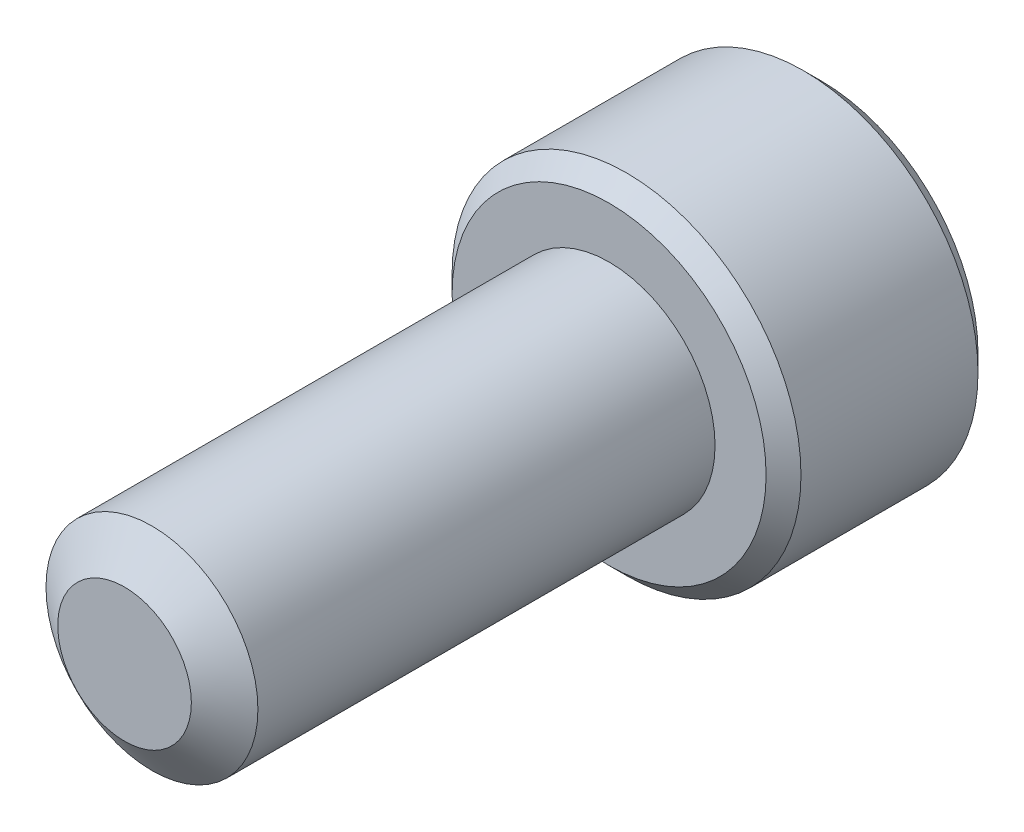
ISO-10303-21;
HEADER;
FILE_DESCRIPTION(('STEP AP214'),'2;1');
FILE_NAME('part.step','',(''),(''),'','','');
FILE_SCHEMA(('AUTOMOTIVE_DESIGN { 1 0 10303 214 1 1 1 1 }'));
ENDSEC;
DATA;
#1=APPLICATION_CONTEXT('core data for automotive mechanical design processes');
#2=APPLICATION_PROTOCOL_DEFINITION('international standard','automotive_design',2000,#1);
#3=PRODUCT_CONTEXT('',#1,'mechanical');
#4=PRODUCT('Part','Part','',(#3));
#5=PRODUCT_RELATED_PRODUCT_CATEGORY('part','',(#4));
#6=PRODUCT_DEFINITION_FORMATION('','',#4);
#7=PRODUCT_DEFINITION_CONTEXT('part definition',#1,'design');
#8=PRODUCT_DEFINITION('design','',#6,#7);
#9=PRODUCT_DEFINITION_SHAPE('','',#8);
#10=(LENGTH_UNIT() NAMED_UNIT(*) SI_UNIT(.MILLI.,.METRE.));
#11=(NAMED_UNIT(*) PLANE_ANGLE_UNIT() SI_UNIT($,.RADIAN.));
#12=(NAMED_UNIT(*) SI_UNIT($,.STERADIAN.) SOLID_ANGLE_UNIT());
#13=UNCERTAINTY_MEASURE_WITH_UNIT(LENGTH_MEASURE(1.E-05),#10,'distance_accuracy_value','');
#14=(GEOMETRIC_REPRESENTATION_CONTEXT(3) GLOBAL_UNCERTAINTY_ASSIGNED_CONTEXT((#13)) GLOBAL_UNIT_ASSIGNED_CONTEXT((#10,
#11,#12)) REPRESENTATION_CONTEXT('',''));
#15=CARTESIAN_POINT('',(0.,0.,0.));
#16=DIRECTION('',(0.,0.,1.));
#17=DIRECTION('',(1.,0.,0.));
#18=AXIS2_PLACEMENT_3D('',#15,#16,#17);
#19=CARTESIAN_POINT('',(0.,0.,-9.525));
#20=DIRECTION('',(0.,0.,1.));
#21=DIRECTION('',(1.,0.,0.));
#22=AXIS2_PLACEMENT_3D('',#19,#20,#21);
#23=CYLINDRICAL_SURFACE('',#22,2.0828);
#24=CARTESIAN_POINT('',(0.,0.,-9.525));
#25=DIRECTION('',(0.,0.,-1.));
#26=DIRECTION('',(-1.,0.,0.));
#27=AXIS2_PLACEMENT_3D('',#24,#25,#26);
#28=CIRCLE('',#27,2.0828);
#29=CARTESIAN_POINT('',(2.0828,0.,-9.525));
#30=VERTEX_POINT('',#29);
#31=EDGE_CURVE('E210',#30,#30,#28,.F.);
#32=CARTESIAN_POINT('',(0.,0.,-0.538848735955547));
#33=DIRECTION('',(0.,0.,1.));
#34=DIRECTION('',(1.,0.,0.));
#35=AXIS2_PLACEMENT_3D('',#32,#33,#34);
#36=CIRCLE('',#35,2.0828);
#37=CARTESIAN_POINT('',(2.0828,0.,-0.538848735955548));
#38=VERTEX_POINT('',#37);
#39=EDGE_CURVE('E107',#38,#38,#36,.T.);
#40=CARTESIAN_POINT('',(2.0828,0.,-9.525));
#41=CARTESIAN_POINT('',(2.0828,0.,-9.4313942576662));
#42=CARTESIAN_POINT('',(2.0828,0.,-9.33778851533241));
#43=CARTESIAN_POINT('',(2.0828,0.,-9.15057703066481));
#44=CARTESIAN_POINT('',(2.0828,0.,-9.05697128833102));
#45=CARTESIAN_POINT('',(2.0828,0.,-8.86975980366342));
#46=CARTESIAN_POINT('',(2.0828,0.,-8.77615406132963));
#47=CARTESIAN_POINT('',(2.0828,0.,-8.58894257666203));
#48=CARTESIAN_POINT('',(2.0828,0.,-8.49533683432824));
#49=CARTESIAN_POINT('',(2.0828,0.,-8.30812534966065));
#50=CARTESIAN_POINT('',(2.0828,0.,-8.21451960732685));
#51=CARTESIAN_POINT('',(2.0828,0.,-8.02730812265926));
#52=CARTESIAN_POINT('',(2.0828,0.,-7.93370238032546));
#53=CARTESIAN_POINT('',(2.0828,0.,-7.74649089565787));
#54=CARTESIAN_POINT('',(2.0828,0.,-7.65288515332407));
#55=CARTESIAN_POINT('',(2.0828,0.,-7.46567366865648));
#56=CARTESIAN_POINT('',(2.0828,0.,-7.37206792632268));
#57=CARTESIAN_POINT('',(2.0828,0.,-7.18485644165509));
#58=CARTESIAN_POINT('',(2.0828,0.,-7.09125069932129));
#59=CARTESIAN_POINT('',(2.0828,0.,-6.9040392146537));
#60=CARTESIAN_POINT('',(2.0828,0.,-6.8104334723199));
#61=CARTESIAN_POINT('',(2.0828,0.,-6.62322198765231));
#62=CARTESIAN_POINT('',(2.0828,0.,-6.52961624531851));
#63=CARTESIAN_POINT('',(2.0828,0.,-6.34240476065092));
#64=CARTESIAN_POINT('',(2.0828,0.,-6.24879901831713));
#65=CARTESIAN_POINT('',(2.0828,0.,-6.06158753364953));
#66=CARTESIAN_POINT('',(2.0828,0.,-5.96798179131574));
#67=CARTESIAN_POINT('',(2.0828,0.,-5.78077030664814));
#68=CARTESIAN_POINT('',(2.0828,0.,-5.68716456431435));
#69=CARTESIAN_POINT('',(2.0828,0.,-5.49995307964676));
#70=CARTESIAN_POINT('',(2.0828,0.,-5.40634733731296));
#71=CARTESIAN_POINT('',(2.0828,0.,-5.21913585264537));
#72=CARTESIAN_POINT('',(2.0828,0.,-5.12553011031157));
#73=CARTESIAN_POINT('',(2.0828,0.,-4.93831862564398));
#74=CARTESIAN_POINT('',(2.0828,0.,-4.84471288331018));
#75=CARTESIAN_POINT('',(2.0828,0.,-4.65750139864259));
#76=CARTESIAN_POINT('',(2.0828,0.,-4.56389565630879));
#77=CARTESIAN_POINT('',(2.0828,0.,-4.3766841716412));
#78=CARTESIAN_POINT('',(2.0828,0.,-4.2830784293074));
#79=CARTESIAN_POINT('',(2.0828,0.,-4.09586694463981));
#80=CARTESIAN_POINT('',(2.0828,0.,-4.00226120230601));
#81=CARTESIAN_POINT('',(2.0828,0.,-3.81504971763842));
#82=CARTESIAN_POINT('',(2.0828,0.,-3.72144397530462));
#83=CARTESIAN_POINT('',(2.0828,0.,-3.53423249063703));
#84=CARTESIAN_POINT('',(2.0828,0.,-3.44062674830323));
#85=CARTESIAN_POINT('',(2.0828,0.,-3.25341526363564));
#86=CARTESIAN_POINT('',(2.0828,0.,-3.15980952130185));
#87=CARTESIAN_POINT('',(2.0828,0.,-2.97259803663425));
#88=CARTESIAN_POINT('',(2.0828,0.,-2.87899229430046));
#89=CARTESIAN_POINT('',(2.0828,0.,-2.69178080963286));
#90=CARTESIAN_POINT('',(2.0828,0.,-2.59817506729907));
#91=CARTESIAN_POINT('',(2.0828,0.,-2.41096358263147));
#92=CARTESIAN_POINT('',(2.0828,0.,-2.31735784029768));
#93=CARTESIAN_POINT('',(2.0828,0.,-2.13014635563009));
#94=CARTESIAN_POINT('',(2.0828,0.,-2.03654061329629));
#95=CARTESIAN_POINT('',(2.0828,0.,-1.8493291286287));
#96=CARTESIAN_POINT('',(2.0828,0.,-1.7557233862949));
#97=CARTESIAN_POINT('',(2.0828,0.,-1.56851190162731));
#98=CARTESIAN_POINT('',(2.0828,0.,-1.47490615929351));
#99=CARTESIAN_POINT('',(2.0828,0.,-1.28769467462592));
#100=CARTESIAN_POINT('',(2.0828,0.,-1.19408893229212));
#101=CARTESIAN_POINT('',(2.0828,0.,-1.00687744762453));
#102=CARTESIAN_POINT('',(2.0828,0.,-0.913271705290733));
#103=CARTESIAN_POINT('',(2.0828,0.,-0.726060220623141));
#104=CARTESIAN_POINT('',(2.0828,0.,-0.632454478289344));
#105=CARTESIAN_POINT('',(2.0828,0.,-0.538848735955548));
#106=B_SPLINE_CURVE_WITH_KNOTS('',3,(#40,#41,#42,#43,#44,#45,#46,#47,#48,#49,#50,#51,#52,#53,
#54,#55,#56,#57,#58,#59,#60,#61,#62,#63,#64,#65,#66,#67,#68,#69,#70,#71,#72,#73,#74,#75,#76,#77,
#78,#79,#80,#81,#82,#83,#84,#85,#86,#87,#88,#89,#90,#91,#92,#93,#94,#95,#96,#97,#98,#99,#100,
#101,#102,#103,#104,#105),.UNSPECIFIED.,.F.,.F.,(4,2,2,2,2,2,2,2,2,2,2,2,2,2,2,2,2,2,2,2,2,2,2,
2,2,2,2,2,2,2,2,2,4),(0.,0.280817227001391,0.56163445400278,0.842451681004169,1.12326890800556,
1.40408613500695,1.68490336200834,1.96572058900973,2.24653781601111,2.5273550430125,
2.80817227001389,3.08898949701528,3.36980672401667,3.65062395101806,3.93144117801945,
4.21225840502084,4.49307563202223,4.77389285902362,5.054710086025,5.33552731302639,
5.61634454002778,5.89716176702917,6.17797899403056,6.45879622103195,6.73961344803334,
7.02043067503473,7.30124790203612,7.58206512903751,7.8628823560389,8.14369958304029,
8.42451681004168,8.70533403704306,8.98615126404445),.UNSPECIFIED.);
#107=EDGE_CURVE('BSEAM33',#30,#38,#106,.T.);
#108=ORIENTED_EDGE('',*,*,#31,.T.);
#109=ORIENTED_EDGE('',*,*,#39,.F.);
#110=ORIENTED_EDGE('',*,*,#107,.T.);
#111=ORIENTED_EDGE('',*,*,#107,.F.);
#112=EDGE_LOOP('',(#108,#110,#109,#111));
#113=FACE_BOUND('',#112,.T.);
#114=ADVANCED_FACE('F33',(#113),#23,.T.);
#115=CARTESIAN_POINT('',(0.,0.,0.));
#116=DIRECTION('',(0.,0.,-1.));
#117=DIRECTION('',(-1.,0.,0.));
#118=AXIS2_PLACEMENT_3D('',#115,#116,#117);
#119=CONICAL_SURFACE('',#118,1.31324425180957,0.959931088596884);
#120=ORIENTED_EDGE('',*,*,#39,.T.);
#121=EDGE_LOOP('',(#120));
#122=FACE_BOUND('',#121,.T.);
#123=CARTESIAN_POINT('',(0.,0.,0.));
#124=DIRECTION('',(0.,0.,1.));
#125=DIRECTION('',(1.,0.,0.));
#126=AXIS2_PLACEMENT_3D('',#123,#124,#125);
#127=CIRCLE('',#126,1.31324425180957);
#128=CARTESIAN_POINT('',(1.31324425180957,0.,0.));
#129=VERTEX_POINT('',#128);
#130=EDGE_CURVE('E208',#129,#129,#127,.T.);
#131=ORIENTED_EDGE('',*,*,#130,.F.);
#132=EDGE_LOOP('',(#131));
#133=FACE_BOUND('',#132,.T.);
#134=ADVANCED_FACE('F191',(#122,#133),#119,.T.);
#135=CARTESIAN_POINT('',(0.,0.,0.));
#136=DIRECTION('',(0.,0.,1.));
#137=DIRECTION('',(1.,0.,0.));
#138=AXIS2_PLACEMENT_3D('',#135,#136,#137);
#139=PLANE('',#138);
#140=ORIENTED_EDGE('',*,*,#130,.T.);
#141=EDGE_LOOP('',(#140));
#142=FACE_BOUND('',#141,.T.);
#143=ADVANCED_FACE('F188',(#142),#139,.T.);
#144=CARTESIAN_POINT('',(0.,0.,-13.6906));
#145=DIRECTION('',(0.,0.,1.));
#146=DIRECTION('',(1.,0.,0.));
#147=AXIS2_PLACEMENT_3D('',#144,#145,#146);
#148=CYLINDRICAL_SURFACE('',#147,3.429);
#149=CARTESIAN_POINT('',(0.,0.,-13.3477));
#150=DIRECTION('',(0.,0.,-1.));
#151=DIRECTION('',(-1.,0.,0.));
#152=AXIS2_PLACEMENT_3D('',#149,#150,#151);
#153=CIRCLE('',#152,3.429);
#154=CARTESIAN_POINT('',(3.429,0.,-13.3477));
#155=VERTEX_POINT('',#154);
#156=EDGE_CURVE('E41',#155,#155,#153,.F.);
#157=ORIENTED_EDGE('',*,*,#156,.T.);
#158=EDGE_LOOP('',(#157));
#159=FACE_BOUND('',#158,.T.);
#160=CARTESIAN_POINT('',(0.,0.,-9.8679));
#161=DIRECTION('',(0.,0.,-1.));
#162=DIRECTION('',(-1.,0.,0.));
#163=AXIS2_PLACEMENT_3D('',#160,#161,#162);
#164=CIRCLE('',#163,3.429);
#165=CARTESIAN_POINT('',(-3.429,0.,-9.8679));
#166=VERTEX_POINT('',#165);
#167=EDGE_CURVE('E167',#166,#166,#164,.T.);
#168=ORIENTED_EDGE('',*,*,#167,.T.);
#169=EDGE_LOOP('',(#168));
#170=FACE_BOUND('',#169,.T.);
#171=ADVANCED_FACE('F172',(#159,#170),#148,.T.);
#172=CARTESIAN_POINT('',(0.,0.,-13.6906));
#173=DIRECTION('',(0.,0.,-1.));
#174=DIRECTION('',(-1.,0.,0.));
#175=AXIS2_PLACEMENT_3D('',#172,#173,#174);
#176=PLANE('',#175);
#177=CARTESIAN_POINT('',(0.,0.,-13.6906));
#178=DIRECTION('',(0.,0.,-1.));
#179=DIRECTION('',(-1.,0.,0.));
#180=AXIS2_PLACEMENT_3D('',#177,#178,#179);
#181=CIRCLE('',#180,3.0861);
#182=CARTESIAN_POINT('',(3.0861,0.,-13.6906));
#183=VERTEX_POINT('',#182);
#184=EDGE_CURVE('E106',#183,#183,#181,.T.);
#185=ORIENTED_EDGE('',*,*,#184,.T.);
#186=EDGE_LOOP('',(#185));
#187=FACE_BOUND('',#186,.T.);
#188=CARTESIAN_POINT('',(0.,0.,-13.6906));
#189=DIRECTION('',(0.,0.,-1.));
#190=DIRECTION('',(-1.,0.,0.));
#191=AXIS2_PLACEMENT_3D('',#188,#189,#190);
#192=CIRCLE('',#191,2.06222299276169);
#193=CARTESIAN_POINT('',(-1.7859375,1.03111149638085,-13.6906));
#194=VERTEX_POINT('',#193);
#195=CARTESIAN_POINT('',(0.,2.06222299276169,-13.6906));
#196=VERTEX_POINT('',#195);
#197=EDGE_CURVE('E87',#194,#196,#192,.T.);
#198=ORIENTED_EDGE('',*,*,#197,.F.);
#199=CARTESIAN_POINT('',(-1.7859375,-1.03111149638085,-13.6906));
#200=VERTEX_POINT('',#199);
#201=EDGE_CURVE('E47',#200,#194,#192,.T.);
#202=ORIENTED_EDGE('',*,*,#201,.F.);
#203=CARTESIAN_POINT('',(0.,-2.06222299276169,-13.6906));
#204=VERTEX_POINT('',#203);
#205=EDGE_CURVE('E266',#204,#200,#192,.T.);
#206=ORIENTED_EDGE('',*,*,#205,.F.);
#207=CARTESIAN_POINT('',(1.7859375,-1.03111149638085,-13.6906));
#208=VERTEX_POINT('',#207);
#209=EDGE_CURVE('E54',#208,#204,#192,.T.);
#210=ORIENTED_EDGE('',*,*,#209,.F.);
#211=CARTESIAN_POINT('',(1.7859375,1.03111149638085,-13.6906));
#212=VERTEX_POINT('',#211);
#213=EDGE_CURVE('E128',#212,#208,#192,.T.);
#214=ORIENTED_EDGE('',*,*,#213,.F.);
#215=EDGE_CURVE('E96',#196,#212,#192,.T.);
#216=ORIENTED_EDGE('',*,*,#215,.F.);
#217=EDGE_LOOP('',(#198,#202,#206,#210,#214,#216));
#218=FACE_BOUND('',#217,.T.);
#219=ADVANCED_FACE('F127',(#187,#218),#176,.T.);
#220=CARTESIAN_POINT('',(0.,0.,-9.525));
#221=DIRECTION('',(0.,0.,-1.));
#222=DIRECTION('',(-1.,0.,0.));
#223=AXIS2_PLACEMENT_3D('',#220,#221,#222);
#224=PLANE('',#223);
#225=CARTESIAN_POINT('',(0.,0.,-9.525));
#226=DIRECTION('',(0.,0.,-1.));
#227=DIRECTION('',(-1.,0.,0.));
#228=AXIS2_PLACEMENT_3D('',#225,#226,#227);
#229=CIRCLE('',#228,3.0861);
#230=CARTESIAN_POINT('',(-3.0861,0.,-9.525));
#231=VERTEX_POINT('',#230);
#232=EDGE_CURVE('E11',#231,#231,#229,.F.);
#233=ORIENTED_EDGE('',*,*,#232,.T.);
#234=EDGE_LOOP('',(#233));
#235=FACE_BOUND('',#234,.T.);
#236=ORIENTED_EDGE('',*,*,#31,.F.);
#237=EDGE_LOOP('',(#236));
#238=FACE_BOUND('',#237,.T.);
#239=ADVANCED_FACE('F181',(#235,#238),#224,.F.);
#240=CARTESIAN_POINT('',(0.,0.,-13.6906));
#241=DIRECTION('',(0.,0.,-1.));
#242=DIRECTION('',(-1.,0.,0.));
#243=AXIS2_PLACEMENT_3D('',#240,#241,#242);
#244=CONICAL_SURFACE('',#243,2.06222299276169,0.78539816339745);
#245=ORIENTED_EDGE('',*,*,#215,.T.);
#246=CARTESIAN_POINT('',(-0.000199999999999635,2.06233846281553,-13.6907154797516));
#247=CARTESIAN_POINT('',(0.0611956015759156,2.02689169571862,-13.6552968302053));
#248=CARTESIAN_POINT('',(0.123617860874081,1.9908521875094,-13.6219581781509));
#249=CARTESIAN_POINT('',(0.25090396053589,1.91736352360556,-13.5609155592055));
#250=CARTESIAN_POINT('',(0.315779909798269,1.87990737683499,-13.5332455621251));
#251=CARTESIAN_POINT('',(0.446599209311715,1.8043788190457,-13.4858461265527));
#252=CARTESIAN_POINT('',(0.512509233513534,1.76632564883049,-13.4659975342861));
#253=CARTESIAN_POINT('',(0.645780477682403,1.68938146013435,-13.4354164816143));
#254=CARTESIAN_POINT('',(0.713137624857636,1.65049279308089,-13.4246611886412));
#255=CARTESIAN_POINT('',(0.829220820670578,1.58347212872989,-13.4149572559589));
#256=CARTESIAN_POINT('',(0.877796848686672,1.55542674587864,-13.413520545453));
#257=CARTESIAN_POINT('',(0.974869540343766,1.49938180121945,-13.4159394477888));
#258=CARTESIAN_POINT('',(1.02336617019129,1.4713822589222,-13.4197969161715));
#259=CARTESIAN_POINT('',(1.11988817846821,1.4156552514608,-13.4325828827439));
#260=CARTESIAN_POINT('',(1.16791312509815,1.38792803559618,-13.4415156537155));
#261=CARTESIAN_POINT('',(1.26315922323819,1.33293767519577,-13.4639673141422));
#262=CARTESIAN_POINT('',(1.31037998091306,1.30567475804084,-13.477488386438));
#263=CARTESIAN_POINT('',(1.43132294865621,1.23584830305774,-13.5176273746341));
#264=CARTESIAN_POINT('',(1.50429529371242,1.19371769999614,-13.5472707839069));
#265=CARTESIAN_POINT('',(1.61159442773943,1.13176851608183,-13.597313490254));
#266=CARTESIAN_POINT('',(1.64695424171411,1.11135351796506,-13.614896283774));
#267=CARTESIAN_POINT('',(1.71701878052223,1.07090173762354,-13.6516647691481));
#268=CARTESIAN_POINT('',(1.75172389195438,1.05086473219594,-13.670849476289));
#269=CARTESIAN_POINT('',(1.7861375,1.03099602632701,-13.6907154797516));
#270=B_SPLINE_CURVE_WITH_KNOTS('',3,(#246,#247,#248,#249,#250,#251,#252,#253,#254,#255,#256,
#257,#258,#259,#260,#261,#262,#263,#264,#265,#266,#267,#268,#269),.UNSPECIFIED.,.F.,.F.,(4,2,2,
2,2,2,2,2,2,2,2,4),(0.,0.2379111404238,0.477208767673629,0.712705150046279,0.947608448198474,
1.11569769827263,1.28384587649986,1.45213582505427,1.62050594845156,1.88791495712909,
2.02125696737758,2.15451760593925),.UNSPECIFIED.);
#271=EDGE_CURVE('E101',#196,#212,#270,.T.);
#272=ORIENTED_EDGE('',*,*,#271,.F.);
#273=EDGE_LOOP('',(#245,#272));
#274=FACE_BOUND('',#273,.T.);
#275=ADVANCED_FACE('F102',(#274),#244,.F.);
#276=ORIENTED_EDGE('',*,*,#213,.T.);
#277=CARTESIAN_POINT('',(1.7859375,-2.0564571794204,-14.3520856709349));
#278=CARTESIAN_POINT('',(1.7859375,-2.00638471909862,-14.3142880169957));
#279=CARTESIAN_POINT('',(1.7859375,-1.9560318889355,-14.2768564486687));
#280=CARTESIAN_POINT('',(1.7859375,-1.85465493232354,-14.2028876153243));
#281=CARTESIAN_POINT('',(1.7859375,-1.80363064053091,-14.1663505771645));
#282=CARTESIAN_POINT('',(1.7859375,-1.7004269625614,-14.0940731528572));
#283=CARTESIAN_POINT('',(1.7859375,-1.64824168967413,-14.058341132932));
#284=CARTESIAN_POINT('',(1.7859375,-1.54298521924056,-13.9882166560612));
#285=CARTESIAN_POINT('',(1.7859375,-1.48991408466505,-13.9538241044749));
#286=CARTESIAN_POINT('',(1.7859375,-1.32304925075432,-13.8492275506123));
#287=CARTESIAN_POINT('',(1.7859375,-1.20747518485095,-13.7818130981851));
#288=CARTESIAN_POINT('',(1.7859375,-0.970563462349317,-13.6584971938958));
#289=CARTESIAN_POINT('',(1.7859375,-0.849247003266682,-13.6025569298341));
#290=CARTESIAN_POINT('',(1.7859375,-0.667147590400393,-13.5341193208198));
#291=CARTESIAN_POINT('',(1.7859375,-0.609061867992985,-13.5144772551934));
#292=CARTESIAN_POINT('',(1.7859375,-0.491488306301485,-13.479856417184));
#293=CARTESIAN_POINT('',(1.7859375,-0.43200037072796,-13.464877966059));
#294=CARTESIAN_POINT('',(1.7859375,-0.312971553025678,-13.4406118427828));
#295=CARTESIAN_POINT('',(1.7859375,-0.25345086433121,-13.4312266687623));
#296=CARTESIAN_POINT('',(1.7859375,-0.133772958047115,-13.4183303326389));
#297=CARTESIAN_POINT('',(1.7859375,-0.0736158516653915,-13.4148181608046));
#298=CARTESIAN_POINT('',(1.7859375,0.0445641075801576,-13.4139283461994));
#299=CARTESIAN_POINT('',(1.7859375,0.102585397592692,-13.4163332609875));
#300=CARTESIAN_POINT('',(1.7859375,0.218130764261559,-13.4266652894478));
#301=CARTESIAN_POINT('',(1.7859375,0.275654792066327,-13.4345929395753));
#302=CARTESIAN_POINT('',(1.7859375,0.390762936235965,-13.4556721191996));
#303=CARTESIAN_POINT('',(1.7859375,0.448330524172478,-13.4689125456089));
#304=CARTESIAN_POINT('',(1.7859375,0.562208055257706,-13.4999135632709));
#305=CARTESIAN_POINT('',(1.7859375,0.618518103209719,-13.5176737763043));
#306=CARTESIAN_POINT('',(1.7859375,0.795802935443477,-13.5802710135077));
#307=CARTESIAN_POINT('',(1.7859375,0.914253068308211,-13.6322371701308));
#308=CARTESIAN_POINT('',(1.7859375,1.14559793318386,-13.7477773029299));
#309=CARTESIAN_POINT('',(1.7859375,1.25847079443432,-13.8113929824275));
#310=CARTESIAN_POINT('',(1.7859375,1.42161019191199,-13.9106649974319));
#311=CARTESIAN_POINT('',(1.7859375,1.47364444169481,-13.9434728465278));
#312=CARTESIAN_POINT('',(1.7859375,1.57681993847581,-14.0104743669625));
#313=CARTESIAN_POINT('',(1.7859375,1.62796111741225,-14.0446681432702));
#314=CARTESIAN_POINT('',(1.7859375,1.72905230775829,-14.1139049280038));
#315=CARTESIAN_POINT('',(1.7859375,1.77900862061027,-14.1489387817349));
#316=CARTESIAN_POINT('',(1.7859375,1.87823853645449,-14.2199329715092));
#317=CARTESIAN_POINT('',(1.7859375,1.92751232341313,-14.2558930501216));
#318=CARTESIAN_POINT('',(1.7859375,1.9765003414196,-14.2922325501569));
#319=B_SPLINE_CURVE_WITH_KNOTS('',3,(#277,#278,#279,#280,#281,#282,#283,#284,#285,#286,#287,
#288,#289,#290,#291,#292,#293,#294,#295,#296,#297,#298,#299,#300,#301,#302,#303,#304,#305,#306,
#307,#308,#309,#310,#311,#312,#313,#314,#315,#316,#317,#318),.UNSPECIFIED.,.F.,.F.,(4,2,2,2,2,2,
2,2,2,2,2,2,2,2,2,2,2,2,2,2,4),(0.,0.188213463007488,0.376474173620912,0.566193581980193,
0.755899561234067,1.15694956004514,1.55661975691516,1.74041450774974,1.92422191668028,
2.104723615629,2.28519427815575,2.45913267060715,2.63308796106198,2.81008419387739,
2.9870656203721,3.37397665720655,3.76230085312826,3.94682415462261,4.13136145796744,
4.31439974248596,4.49738769171718),.UNSPECIFIED.);
#320=EDGE_CURVE('E95',#212,#208,#319,.F.);
#321=ORIENTED_EDGE('',*,*,#320,.F.);
#322=EDGE_LOOP('',(#276,#321));
#323=FACE_BOUND('',#322,.T.);
#324=ADVANCED_FACE('F272',(#323),#244,.F.);
#325=ORIENTED_EDGE('',*,*,#209,.T.);
#326=CARTESIAN_POINT('',(1.7861375,-1.03099602632701,-13.6907154797516));
#327=CARTESIAN_POINT('',(1.72474189842408,-1.06644279342392,-13.6552968302053));
#328=CARTESIAN_POINT('',(1.66231963912592,-1.10248230163314,-13.6219581781509));
#329=CARTESIAN_POINT('',(1.53503353946411,-1.17597096553699,-13.5609155592055));
#330=CARTESIAN_POINT('',(1.47015759020173,-1.21342711230755,-13.5332455621251));
#331=CARTESIAN_POINT('',(1.33933829068829,-1.28895567009684,-13.4858461265527));
#332=CARTESIAN_POINT('',(1.27342826648647,-1.32700884031205,-13.4659975342861));
#333=CARTESIAN_POINT('',(1.1401570223176,-1.40395302900819,-13.4354164816143));
#334=CARTESIAN_POINT('',(1.07279987514237,-1.44284169606165,-13.4246611886412));
#335=CARTESIAN_POINT('',(0.956716679329423,-1.50986236041265,-13.4149572559589));
#336=CARTESIAN_POINT('',(0.908140651313329,-1.5379077432639,-13.413520545453));
#337=CARTESIAN_POINT('',(0.811067959656235,-1.59395268792309,-13.4159394477888));
#338=CARTESIAN_POINT('',(0.762571329808711,-1.62195223022034,-13.4197969161715));
#339=CARTESIAN_POINT('',(0.666049321531795,-1.67767923768175,-13.4325828827439));
#340=CARTESIAN_POINT('',(0.618024374901855,-1.70540645354636,-13.4415156537155));
#341=CARTESIAN_POINT('',(0.522778276761816,-1.76039681394677,-13.4639673141422));
#342=CARTESIAN_POINT('',(0.475557519086938,-1.7876597311017,-13.477488386438));
#343=CARTESIAN_POINT('',(0.354614551343791,-1.8574861860848,-13.5176273746341));
#344=CARTESIAN_POINT('',(0.281642206287578,-1.8996167891464,-13.5472707839069));
#345=CARTESIAN_POINT('',(0.174343072260569,-1.96156597306071,-13.597313490254));
#346=CARTESIAN_POINT('',(0.138983258285892,-1.98198097117748,-13.614896283774));
#347=CARTESIAN_POINT('',(0.0689187194777748,-2.022432751519,-13.6516647691481));
#348=CARTESIAN_POINT('',(0.0342136080456216,-2.04246975694661,-13.670849476289));
#349=CARTESIAN_POINT('',(-0.000199999999999731,-2.06233846281553,-13.6907154797516));
#350=B_SPLINE_CURVE_WITH_KNOTS('',3,(#326,#327,#328,#329,#330,#331,#332,#333,#334,#335,#336,
#337,#338,#339,#340,#341,#342,#343,#344,#345,#346,#347,#348,#349),.UNSPECIFIED.,.F.,.F.,(4,2,2,
2,2,2,2,2,2,2,2,4),(0.,0.237911140423799,0.477208767673628,0.712705150046277,0.947608448198473,
1.11569769827263,1.28384587649986,1.45213582505427,1.62050594845156,1.88791495712909,
2.02125696737758,2.15451760593925),.UNSPECIFIED.);
#351=EDGE_CURVE('E137',#208,#204,#350,.T.);
#352=ORIENTED_EDGE('',*,*,#351,.F.);
#353=EDGE_LOOP('',(#325,#352));
#354=FACE_BOUND('',#353,.T.);
#355=ADVANCED_FACE('F269',(#354),#244,.F.);
#356=ORIENTED_EDGE('',*,*,#205,.T.);
#357=CARTESIAN_POINT('',(0.00020000000000029,-2.06233846281553,-13.6907154797516));
#358=CARTESIAN_POINT('',(-0.0611956015759149,-2.02689169571862,-13.6552968302053));
#359=CARTESIAN_POINT('',(-0.123617860874081,-1.9908521875094,-13.6219581781509));
#360=CARTESIAN_POINT('',(-0.250903960535889,-1.91736352360556,-13.5609155592055));
#361=CARTESIAN_POINT('',(-0.315779909798268,-1.87990737683499,-13.5332455621251));
#362=CARTESIAN_POINT('',(-0.446599209311714,-1.8043788190457,-13.4858461265527));
#363=CARTESIAN_POINT('',(-0.512509233513533,-1.76632564883049,-13.4659975342861));
#364=CARTESIAN_POINT('',(-0.645780477682402,-1.68938146013435,-13.4354164816143));
#365=CARTESIAN_POINT('',(-0.713137624857636,-1.65049279308089,-13.4246611886412));
#366=CARTESIAN_POINT('',(-0.829220820670578,-1.58347212872989,-13.4149572559589));
#367=CARTESIAN_POINT('',(-0.877796848686672,-1.55542674587864,-13.413520545453));
#368=CARTESIAN_POINT('',(-0.974869540343765,-1.49938180121945,-13.4159394477888));
#369=CARTESIAN_POINT('',(-1.02336617019129,-1.4713822589222,-13.4197969161715));
#370=CARTESIAN_POINT('',(-1.11988817846821,-1.4156552514608,-13.4325828827439));
#371=CARTESIAN_POINT('',(-1.16791312509815,-1.38792803559618,-13.4415156537155));
#372=CARTESIAN_POINT('',(-1.26315922323818,-1.33293767519577,-13.4639673141422));
#373=CARTESIAN_POINT('',(-1.31037998091306,-1.30567475804084,-13.477488386438));
#374=CARTESIAN_POINT('',(-1.43132294865621,-1.23584830305774,-13.5176273746341));
#375=CARTESIAN_POINT('',(-1.50429529371242,-1.19371769999614,-13.5472707839069));
#376=CARTESIAN_POINT('',(-1.61159442773943,-1.13176851608183,-13.597313490254));
#377=CARTESIAN_POINT('',(-1.64695424171411,-1.11135351796506,-13.614896283774));
#378=CARTESIAN_POINT('',(-1.71701878052223,-1.07090173762355,-13.6516647691481));
#379=CARTESIAN_POINT('',(-1.75172389195438,-1.05086473219594,-13.670849476289));
#380=CARTESIAN_POINT('',(-1.7861375,-1.03099602632701,-13.6907154797516));
#381=B_SPLINE_CURVE_WITH_KNOTS('',3,(#357,#358,#359,#360,#361,#362,#363,#364,#365,#366,#367,
#368,#369,#370,#371,#372,#373,#374,#375,#376,#377,#378,#379,#380),.UNSPECIFIED.,.F.,.F.,(4,2,2,
2,2,2,2,2,2,2,2,4),(0.,0.2379111404238,0.477208767673629,0.712705150046279,0.947608448198474,
1.11569769827263,1.28384587649986,1.45213582505427,1.62050594845156,1.88791495712909,
2.02125696737758,2.15451760593925),.UNSPECIFIED.);
#382=EDGE_CURVE('E244',#204,#200,#381,.T.);
#383=ORIENTED_EDGE('',*,*,#382,.F.);
#384=EDGE_LOOP('',(#356,#383));
#385=FACE_BOUND('',#384,.T.);
#386=ADVANCED_FACE('F268',(#385),#244,.F.);
#387=ORIENTED_EDGE('',*,*,#201,.T.);
#388=CARTESIAN_POINT('',(-1.7859375,-2.0564571797196,-14.3520856711608));
#389=CARTESIAN_POINT('',(-1.7859375,-2.00638471938942,-14.3142880172129));
#390=CARTESIAN_POINT('',(-1.7859375,-1.95603188921789,-14.2768564488772));
#391=CARTESIAN_POINT('',(-1.7859375,-1.854654932589,-14.2028876155155));
#392=CARTESIAN_POINT('',(-1.7859375,-1.80363064078787,-14.1663505773471));
#393=CARTESIAN_POINT('',(-1.7859375,-1.70042696280105,-14.0940731530224));
#394=CARTESIAN_POINT('',(-1.7859375,-1.64824168990499,-14.0583411330885));
#395=CARTESIAN_POINT('',(-1.7859375,-1.54298521945367,-13.9882166562004));
#396=CARTESIAN_POINT('',(-1.7859375,-1.4899140848692,-13.9538241046057));
#397=CARTESIAN_POINT('',(-1.7859375,-1.32304925092892,-13.8492275507158));
#398=CARTESIAN_POINT('',(-1.7859375,-1.20747518500454,-13.7818130982705));
#399=CARTESIAN_POINT('',(-1.7859375,-0.970563462459105,-13.6584971939475));
#400=CARTESIAN_POINT('',(-1.7859375,-0.849247003353687,-13.6025569298703));
#401=CARTESIAN_POINT('',(-1.7859375,-0.667147590470257,-13.5341193208444));
#402=CARTESIAN_POINT('',(-1.7859375,-0.609061868070027,-13.5144772552185));
#403=CARTESIAN_POINT('',(-1.7859375,-0.491488306393118,-13.4798564172086));
#404=CARTESIAN_POINT('',(-1.7859375,-0.432000370827006,-13.4648779660825));
#405=CARTESIAN_POINT('',(-1.7859375,-0.312971553139305,-13.4406118428026));
#406=CARTESIAN_POINT('',(-1.7859375,-0.253450864452002,-13.4312266687795));
#407=CARTESIAN_POINT('',(-1.7859375,-0.133772958181996,-13.4183303326493));
#408=CARTESIAN_POINT('',(-1.7859375,-0.0736158518071976,-13.4148181608107));
#409=CARTESIAN_POINT('',(-1.7859375,0.0445641074255746,-13.4139283461957));
#410=CARTESIAN_POINT('',(-1.7859375,0.102585397432239,-13.4163332609785));
#411=CARTESIAN_POINT('',(-1.7859375,0.218130764089953,-13.4266652894271));
#412=CARTESIAN_POINT('',(-1.7859375,0.275654791889439,-13.4345929395484));
#413=CARTESIAN_POINT('',(-1.7859375,0.390762936048648,-13.4556721191597));
#414=CARTESIAN_POINT('',(-1.7859375,0.448330523980031,-13.4689125455621));
#415=CARTESIAN_POINT('',(-1.7859375,0.562208055055494,-13.4999135632103));
#416=CARTESIAN_POINT('',(-1.7859375,0.618518103002872,-13.5176737762366));
#417=CARTESIAN_POINT('',(-1.7859375,0.795802935191589,-13.580271013407));
#418=CARTESIAN_POINT('',(-1.7859375,0.914253068018174,-13.6322371699997));
#419=CARTESIAN_POINT('',(-1.7859375,1.14559793282046,-13.7477773027346));
#420=CARTESIAN_POINT('',(-1.7859375,1.25847079403571,-13.8113929821984));
#421=CARTESIAN_POINT('',(-1.7859375,1.42161019146453,-13.9106649971533));
#422=CARTESIAN_POINT('',(-1.7859375,1.47364444123306,-13.943472846234));
#423=CARTESIAN_POINT('',(-1.7859375,1.57681993798567,-14.0104743666382));
#424=CARTESIAN_POINT('',(-1.7859375,1.62796111690802,-14.0446681429306));
#425=CARTESIAN_POINT('',(-1.7859375,1.72905230722622,-14.1139049276337));
#426=CARTESIAN_POINT('',(-1.7859375,1.77900862006445,-14.1489387813497));
#427=CARTESIAN_POINT('',(-1.7859375,1.87823853588125,-14.2199329710938));
#428=CARTESIAN_POINT('',(-1.7859375,1.92751232282623,-14.2558930496911));
#429=CARTESIAN_POINT('',(-1.7859375,1.97650034081905,-14.2922325497113));
#430=B_SPLINE_CURVE_WITH_KNOTS('',3,(#388,#389,#390,#391,#392,#393,#394,#395,#396,#397,#398,
#399,#400,#401,#402,#403,#404,#405,#406,#407,#408,#409,#410,#411,#412,#413,#414,#415,#416,#417,
#418,#419,#420,#421,#422,#423,#424,#425,#426,#427,#428,#429),.UNSPECIFIED.,.F.,.F.,(4,2,2,2,2,2,
2,2,2,2,2,2,2,2,2,2,2,2,2,2,4),(0.,0.188213463043315,0.376474173692572,0.566193582088361,
0.755899561378737,1.15694956027169,1.5566197572228,1.74041450803663,1.92422191694645,
2.10472361587529,2.28519427838216,2.45913267081537,2.63308796125199,2.8100841940478,
2.98706562052292,3.37397665721653,3.76230085299647,3.94682415443018,4.13136145771436,
4.31439974217306,4.49738769134445),.UNSPECIFIED.);
#431=EDGE_CURVE('E117',#200,#194,#430,.T.);
#432=ORIENTED_EDGE('',*,*,#431,.F.);
#433=EDGE_LOOP('',(#387,#432));
#434=FACE_BOUND('',#433,.T.);
#435=ADVANCED_FACE('F281',(#434),#244,.F.);
#436=ORIENTED_EDGE('',*,*,#197,.T.);
#437=CARTESIAN_POINT('',(-1.7861375,1.03099602632701,-13.6907154797516));
#438=CARTESIAN_POINT('',(-1.72474189842408,1.06644279342392,-13.6552968302053));
#439=CARTESIAN_POINT('',(-1.66231963912592,1.10248230163314,-13.6219581781509));
#440=CARTESIAN_POINT('',(-1.53503353946411,1.17597096553699,-13.5609155592055));
#441=CARTESIAN_POINT('',(-1.47015759020173,1.21342711230755,-13.5332455621251));
#442=CARTESIAN_POINT('',(-1.33933829068829,1.28895567009684,-13.4858461265527));
#443=CARTESIAN_POINT('',(-1.27342826648647,1.32700884031205,-13.4659975342861));
#444=CARTESIAN_POINT('',(-1.1401570223176,1.40395302900819,-13.4354164816143));
#445=CARTESIAN_POINT('',(-1.07279987514236,1.44284169606165,-13.4246611886412));
#446=CARTESIAN_POINT('',(-0.956716679329423,1.50986236041265,-13.4149572559589));
#447=CARTESIAN_POINT('',(-0.908140651313329,1.5379077432639,-13.413520545453));
#448=CARTESIAN_POINT('',(-0.811067959656235,1.59395268792309,-13.4159394477888));
#449=CARTESIAN_POINT('',(-0.762571329808711,1.62195223022034,-13.4197969161715));
#450=CARTESIAN_POINT('',(-0.666049321531795,1.67767923768175,-13.4325828827439));
#451=CARTESIAN_POINT('',(-0.618024374901855,1.70540645354636,-13.4415156537155));
#452=CARTESIAN_POINT('',(-0.522778276761816,1.76039681394677,-13.4639673141422));
#453=CARTESIAN_POINT('',(-0.475557519086938,1.7876597311017,-13.477488386438));
#454=CARTESIAN_POINT('',(-0.35461455134379,1.8574861860848,-13.5176273746341));
#455=CARTESIAN_POINT('',(-0.281642206287578,1.8996167891464,-13.5472707839069));
#456=CARTESIAN_POINT('',(-0.174343072260569,1.96156597306071,-13.597313490254));
#457=CARTESIAN_POINT('',(-0.138983258285892,1.98198097117748,-13.614896283774));
#458=CARTESIAN_POINT('',(-0.0689187194777745,2.022432751519,-13.6516647691481));
#459=CARTESIAN_POINT('',(-0.0342136080456212,2.04246975694661,-13.670849476289));
#460=CARTESIAN_POINT('',(0.000200000000000331,2.06233846281553,-13.6907154797516));
#461=B_SPLINE_CURVE_WITH_KNOTS('',3,(#437,#438,#439,#440,#441,#442,#443,#444,#445,#446,#447,
#448,#449,#450,#451,#452,#453,#454,#455,#456,#457,#458,#459,#460),.UNSPECIFIED.,.F.,.F.,(4,2,2,
2,2,2,2,2,2,2,2,4),(0.,0.2379111404238,0.477208767673628,0.712705150046277,0.947608448198473,
1.11569769827263,1.28384587649986,1.45213582505427,1.62050594845156,1.88791495712909,
2.02125696737758,2.15451760593925),.UNSPECIFIED.);
#462=EDGE_CURVE('E91',#194,#196,#461,.T.);
#463=ORIENTED_EDGE('',*,*,#462,.F.);
#464=EDGE_LOOP('',(#436,#463));
#465=FACE_BOUND('',#464,.T.);
#466=ADVANCED_FACE('F89',(#465),#244,.F.);
#467=CARTESIAN_POINT('',(1.7859375,3.09333448914254,-11.01169375));
#468=DIRECTION('',(0.,0.,-1.));
#469=DIRECTION('',(-1.,0.,0.));
#470=AXIS2_PLACEMENT_3D('',#467,#468,#469);
#471=PLANE('',#470);
#472=DIRECTION('',(0.866025403784439,0.5,0.));
#473=VECTOR('',#472,1.);
#474=CARTESIAN_POINT('',(-1.7859375,1.03111149638085,-11.01169375));
#475=LINE('',#474,#473);
#476=CARTESIAN_POINT('',(-1.7859375,1.03111149638085,-11.01169375));
#477=VERTEX_POINT('',#476);
#478=CARTESIAN_POINT('',(0.,2.06222299276169,-11.01169375));
#479=VERTEX_POINT('',#478);
#480=EDGE_CURVE('E116',#477,#479,#475,.T.);
#481=ORIENTED_EDGE('',*,*,#480,.T.);
#482=DIRECTION('',(0.866025403784439,-0.5,0.));
#483=VECTOR('',#482,1.);
#484=CARTESIAN_POINT('',(0.,2.06222299276169,-11.01169375));
#485=LINE('',#484,#483);
#486=CARTESIAN_POINT('',(1.7859375,1.03111149638085,-11.01169375));
#487=VERTEX_POINT('',#486);
#488=EDGE_CURVE('E121',#479,#487,#485,.T.);
#489=ORIENTED_EDGE('',*,*,#488,.T.);
#490=DIRECTION('',(0.,-1.,0.));
#491=VECTOR('',#490,1.);
#492=CARTESIAN_POINT('',(1.7859375,1.03111149638085,-11.01169375));
#493=LINE('',#492,#491);
#494=CARTESIAN_POINT('',(1.7859375,-1.03111149638085,-11.01169375));
#495=VERTEX_POINT('',#494);
#496=EDGE_CURVE('E232',#487,#495,#493,.T.);
#497=ORIENTED_EDGE('',*,*,#496,.T.);
#498=DIRECTION('',(-0.866025403784439,-0.5,0.));
#499=VECTOR('',#498,1.);
#500=CARTESIAN_POINT('',(1.7859375,-1.03111149638085,-11.01169375));
#501=LINE('',#500,#499);
#502=CARTESIAN_POINT('',(0.,-2.06222299276169,-11.01169375));
#503=VERTEX_POINT('',#502);
#504=EDGE_CURVE('E229',#495,#503,#501,.T.);
#505=ORIENTED_EDGE('',*,*,#504,.T.);
#506=DIRECTION('',(-0.866025403784439,0.5,0.));
#507=VECTOR('',#506,1.);
#508=CARTESIAN_POINT('',(0.,-2.06222299276169,-11.01169375));
#509=LINE('',#508,#507);
#510=CARTESIAN_POINT('',(-1.7859375,-1.03111149638085,-11.01169375));
#511=VERTEX_POINT('',#510);
#512=EDGE_CURVE('E226',#503,#511,#509,.T.);
#513=ORIENTED_EDGE('',*,*,#512,.T.);
#514=DIRECTION('',(0.,1.,0.));
#515=VECTOR('',#514,1.);
#516=CARTESIAN_POINT('',(-1.7859375,-1.03111149638085,-11.01169375));
#517=LINE('',#516,#515);
#518=EDGE_CURVE('E124',#511,#477,#517,.T.);
#519=ORIENTED_EDGE('',*,*,#518,.T.);
#520=EDGE_LOOP('',(#481,#489,#497,#505,#513,#519));
#521=FACE_BOUND('',#520,.T.);
#522=ADVANCED_FACE('F156',(#521),#471,.T.);
#523=CARTESIAN_POINT('',(0.,2.06222299276169,-11.01169375));
#524=DIRECTION('',(0.5,0.866025403784439,0.));
#525=DIRECTION('',(-0.866025403784439,0.5,0.));
#526=AXIS2_PLACEMENT_3D('',#523,#524,#525);
#527=PLANE('',#526);
#528=DIRECTION('',(0.,0.,-1.));
#529=VECTOR('',#528,1.);
#530=CARTESIAN_POINT('',(0.,2.06222299276169,-11.01169375));
#531=LINE('',#530,#529);
#532=EDGE_CURVE('E113',#479,#196,#531,.T.);
#533=ORIENTED_EDGE('',*,*,#532,.T.);
#534=ORIENTED_EDGE('',*,*,#271,.T.);
#535=DIRECTION('',(0.,0.,-1.));
#536=VECTOR('',#535,1.);
#537=CARTESIAN_POINT('',(1.7859375,1.03111149638085,-11.01169375));
#538=LINE('',#537,#536);
#539=EDGE_CURVE('E123',#487,#212,#538,.T.);
#540=ORIENTED_EDGE('',*,*,#539,.F.);
#541=ORIENTED_EDGE('',*,*,#488,.F.);
#542=EDGE_LOOP('',(#533,#534,#540,#541));
#543=FACE_BOUND('',#542,.T.);
#544=ADVANCED_FACE('F119',(#543),#527,.F.);
#545=CARTESIAN_POINT('',(1.7859375,1.03111149638085,-11.01169375));
#546=DIRECTION('',(1.,0.,0.));
#547=DIRECTION('',(0.,1.,0.));
#548=AXIS2_PLACEMENT_3D('',#545,#546,#547);
#549=PLANE('',#548);
#550=ORIENTED_EDGE('',*,*,#539,.T.);
#551=ORIENTED_EDGE('',*,*,#320,.T.);
#552=DIRECTION('',(0.,0.,-1.));
#553=VECTOR('',#552,1.);
#554=CARTESIAN_POINT('',(1.7859375,-1.03111149638085,-11.01169375));
#555=LINE('',#554,#553);
#556=EDGE_CURVE('E215',#495,#208,#555,.T.);
#557=ORIENTED_EDGE('',*,*,#556,.F.);
#558=ORIENTED_EDGE('',*,*,#496,.F.);
#559=EDGE_LOOP('',(#550,#551,#557,#558));
#560=FACE_BOUND('',#559,.T.);
#561=ADVANCED_FACE('F145',(#560),#549,.F.);
#562=CARTESIAN_POINT('',(1.7859375,-1.03111149638085,-11.01169375));
#563=DIRECTION('',(0.5,-0.866025403784439,0.));
#564=DIRECTION('',(0.866025403784439,0.5,0.));
#565=AXIS2_PLACEMENT_3D('',#562,#563,#564);
#566=PLANE('',#565);
#567=ORIENTED_EDGE('',*,*,#556,.T.);
#568=ORIENTED_EDGE('',*,*,#351,.T.);
#569=DIRECTION('',(0.,0.,-1.));
#570=VECTOR('',#569,1.);
#571=CARTESIAN_POINT('',(0.,-2.06222299276169,-11.01169375));
#572=LINE('',#571,#570);
#573=EDGE_CURVE('E218',#503,#204,#572,.T.);
#574=ORIENTED_EDGE('',*,*,#573,.F.);
#575=ORIENTED_EDGE('',*,*,#504,.F.);
#576=EDGE_LOOP('',(#567,#568,#574,#575));
#577=FACE_BOUND('',#576,.T.);
#578=ADVANCED_FACE('F149',(#577),#566,.F.);
#579=CARTESIAN_POINT('',(0.,-2.06222299276169,-11.01169375));
#580=DIRECTION('',(-0.5,-0.866025403784439,0.));
#581=DIRECTION('',(0.866025403784439,-0.5,0.));
#582=AXIS2_PLACEMENT_3D('',#579,#580,#581);
#583=PLANE('',#582);
#584=ORIENTED_EDGE('',*,*,#573,.T.);
#585=ORIENTED_EDGE('',*,*,#382,.T.);
#586=DIRECTION('',(0.,0.,-1.));
#587=VECTOR('',#586,1.);
#588=CARTESIAN_POINT('',(-1.7859375,-1.03111149638085,-11.01169375));
#589=LINE('',#588,#587);
#590=EDGE_CURVE('E221',#511,#200,#589,.T.);
#591=ORIENTED_EDGE('',*,*,#590,.F.);
#592=ORIENTED_EDGE('',*,*,#512,.F.);
#593=EDGE_LOOP('',(#584,#585,#591,#592));
#594=FACE_BOUND('',#593,.T.);
#595=ADVANCED_FACE('F251',(#594),#583,.F.);
#596=CARTESIAN_POINT('',(-1.7859375,-1.03111149638085,-11.01169375));
#597=DIRECTION('',(-1.,0.,0.));
#598=DIRECTION('',(0.,-1.,0.));
#599=AXIS2_PLACEMENT_3D('',#596,#597,#598);
#600=PLANE('',#599);
#601=ORIENTED_EDGE('',*,*,#590,.T.);
#602=ORIENTED_EDGE('',*,*,#431,.T.);
#603=DIRECTION('',(0.,0.,-1.));
#604=VECTOR('',#603,1.);
#605=CARTESIAN_POINT('',(-1.7859375,1.03111149638085,-11.01169375));
#606=LINE('',#605,#604);
#607=EDGE_CURVE('E115',#477,#194,#606,.T.);
#608=ORIENTED_EDGE('',*,*,#607,.F.);
#609=ORIENTED_EDGE('',*,*,#518,.F.);
#610=EDGE_LOOP('',(#601,#602,#608,#609));
#611=FACE_BOUND('',#610,.T.);
#612=ADVANCED_FACE('F248',(#611),#600,.F.);
#613=CARTESIAN_POINT('',(-1.7859375,1.03111149638085,-11.01169375));
#614=DIRECTION('',(-0.5,0.866025403784439,0.));
#615=DIRECTION('',(-0.866025403784439,-0.5,0.));
#616=AXIS2_PLACEMENT_3D('',#613,#614,#615);
#617=PLANE('',#616);
#618=ORIENTED_EDGE('',*,*,#607,.T.);
#619=ORIENTED_EDGE('',*,*,#462,.T.);
#620=ORIENTED_EDGE('',*,*,#532,.F.);
#621=ORIENTED_EDGE('',*,*,#480,.F.);
#622=EDGE_LOOP('',(#618,#619,#620,#621));
#623=FACE_BOUND('',#622,.T.);
#624=ADVANCED_FACE('F111',(#623),#617,.F.);
#625=CARTESIAN_POINT('',(0.,0.,-13.6906));
#626=DIRECTION('',(0.,0.,1.));
#627=DIRECTION('',(1.,0.,0.));
#628=AXIS2_PLACEMENT_3D('',#625,#626,#627);
#629=CONICAL_SURFACE('',#628,3.0861,0.785398163397446);
#630=CARTESIAN_POINT('',(3.429,0.,-13.3477));
#631=CARTESIAN_POINT('',(3.425428125,0.,-13.351271875));
#632=CARTESIAN_POINT('',(3.42185625,0.,-13.35484375));
#633=CARTESIAN_POINT('',(3.4147125,0.,-13.3619875));
#634=CARTESIAN_POINT('',(3.411140625,0.,-13.365559375));
#635=CARTESIAN_POINT('',(3.403996875,0.,-13.372703125));
#636=CARTESIAN_POINT('',(3.400425,0.,-13.376275));
#637=CARTESIAN_POINT('',(3.39328125,0.,-13.38341875));
#638=CARTESIAN_POINT('',(3.389709375,0.,-13.386990625));
#639=CARTESIAN_POINT('',(3.382565625,0.,-13.394134375));
#640=CARTESIAN_POINT('',(3.37899375,0.,-13.39770625));
#641=CARTESIAN_POINT('',(3.37185,0.,-13.40485));
#642=CARTESIAN_POINT('',(3.368278125,0.,-13.408421875));
#643=CARTESIAN_POINT('',(3.361134375,0.,-13.415565625));
#644=CARTESIAN_POINT('',(3.3575625,0.,-13.4191375));
#645=CARTESIAN_POINT('',(3.35041875,0.,-13.42628125));
#646=CARTESIAN_POINT('',(3.346846875,0.,-13.429853125));
#647=CARTESIAN_POINT('',(3.339703125,0.,-13.436996875));
#648=CARTESIAN_POINT('',(3.33613125,0.,-13.44056875));
#649=CARTESIAN_POINT('',(3.3289875,0.,-13.4477125));
#650=CARTESIAN_POINT('',(3.325415625,0.,-13.451284375));
#651=CARTESIAN_POINT('',(3.318271875,0.,-13.458428125));
#652=CARTESIAN_POINT('',(3.3147,0.,-13.462));
#653=CARTESIAN_POINT('',(3.30755625,0.,-13.46914375));
#654=CARTESIAN_POINT('',(3.303984375,0.,-13.472715625));
#655=CARTESIAN_POINT('',(3.296840625,0.,-13.479859375));
#656=CARTESIAN_POINT('',(3.29326875,0.,-13.48343125));
#657=CARTESIAN_POINT('',(3.286125,0.,-13.490575));
#658=CARTESIAN_POINT('',(3.282553125,0.,-13.494146875));
#659=CARTESIAN_POINT('',(3.275409375,0.,-13.501290625));
#660=CARTESIAN_POINT('',(3.2718375,0.,-13.5048625));
#661=CARTESIAN_POINT('',(3.26469375,0.,-13.51200625));
#662=CARTESIAN_POINT('',(3.261121875,0.,-13.515578125));
#663=CARTESIAN_POINT('',(3.253978125,0.,-13.522721875));
#664=CARTESIAN_POINT('',(3.25040625,0.,-13.52629375));
#665=CARTESIAN_POINT('',(3.2432625,0.,-13.5334375));
#666=CARTESIAN_POINT('',(3.239690625,0.,-13.537009375));
#667=CARTESIAN_POINT('',(3.232546875,0.,-13.544153125));
#668=CARTESIAN_POINT('',(3.228975,0.,-13.547725));
#669=CARTESIAN_POINT('',(3.22183125,0.,-13.55486875));
#670=CARTESIAN_POINT('',(3.218259375,0.,-13.558440625));
#671=CARTESIAN_POINT('',(3.211115625,0.,-13.565584375));
#672=CARTESIAN_POINT('',(3.20754375,0.,-13.56915625));
#673=CARTESIAN_POINT('',(3.2004,0.,-13.5763));
#674=CARTESIAN_POINT('',(3.196828125,0.,-13.579871875));
#675=CARTESIAN_POINT('',(3.189684375,0.,-13.587015625));
#676=CARTESIAN_POINT('',(3.1861125,0.,-13.5905875));
#677=CARTESIAN_POINT('',(3.17896875,0.,-13.59773125));
#678=CARTESIAN_POINT('',(3.175396875,0.,-13.601303125));
#679=CARTESIAN_POINT('',(3.168253125,0.,-13.608446875));
#680=CARTESIAN_POINT('',(3.16468125,0.,-13.61201875));
#681=CARTESIAN_POINT('',(3.1575375,0.,-13.6191625));
#682=CARTESIAN_POINT('',(3.153965625,0.,-13.622734375));
#683=CARTESIAN_POINT('',(3.146821875,0.,-13.629878125));
#684=CARTESIAN_POINT('',(3.14325,0.,-13.63345));
#685=CARTESIAN_POINT('',(3.13610625,0.,-13.64059375));
#686=CARTESIAN_POINT('',(3.132534375,0.,-13.644165625));
#687=CARTESIAN_POINT('',(3.125390625,0.,-13.651309375));
#688=CARTESIAN_POINT('',(3.12181875,0.,-13.65488125));
#689=CARTESIAN_POINT('',(3.114675,0.,-13.662025));
#690=CARTESIAN_POINT('',(3.111103125,0.,-13.665596875));
#691=CARTESIAN_POINT('',(3.103959375,0.,-13.672740625));
#692=CARTESIAN_POINT('',(3.1003875,0.,-13.6763125));
#693=CARTESIAN_POINT('',(3.09324375,0.,-13.68345625));
#694=CARTESIAN_POINT('',(3.089671875,0.,-13.687028125));
#695=CARTESIAN_POINT('',(3.0861,0.,-13.6906));
#696=B_SPLINE_CURVE_WITH_KNOTS('',3,(#630,#631,#632,#633,#634,#635,#636,#637,#638,#639,#640,
#641,#642,#643,#644,#645,#646,#647,#648,#649,#650,#651,#652,#653,#654,#655,#656,#657,#658,#659,
#660,#661,#662,#663,#664,#665,#666,#667,#668,#669,#670,#671,#672,#673,#674,#675,#676,#677,#678,
#679,#680,#681,#682,#683,#684,#685,#686,#687,#688,#689,#690,#691,#692,#693,#694,#695),
.UNSPECIFIED.,.F.,.F.,(4,2,2,2,2,2,2,2,2,2,2,2,2,2,2,2,2,2,2,2,2,2,2,2,2,2,2,2,2,2,2,2,4),(0.,
0.0151541822043036,0.0303083644086075,0.0454625466129123,0.0606167288172159,0.0757709110215195,
0.0909250932258246,0.106079275430128,0.121233457634432,0.136387639838737,0.15154182204304,
0.166696004247344,0.181850186451649,0.197004368655953,0.212158550860256,0.227312733064561,
0.242466915268865,0.257621097473169,0.272775279677473,0.287929461881777,0.303083644086081,
0.318237826290386,0.333392008494689,0.348546190698993,0.363700372903298,0.378854555107602,
0.394008737311905,0.40916291951621,0.424317101720514,0.439471283924818,0.454625466129122,
0.469779648333426,0.484933830537731),.UNSPECIFIED.);
#697=EDGE_CURVE('BSEAM175',#155,#183,#696,.T.);
#698=ORIENTED_EDGE('',*,*,#156,.F.);
#699=ORIENTED_EDGE('',*,*,#184,.F.);
#700=ORIENTED_EDGE('',*,*,#697,.T.);
#701=ORIENTED_EDGE('',*,*,#697,.F.);
#702=EDGE_LOOP('',(#698,#700,#699,#701));
#703=FACE_BOUND('',#702,.T.);
#704=ADVANCED_FACE('F175',(#703),#629,.T.);
#705=CARTESIAN_POINT('',(0.,0.,-9.8679));
#706=DIRECTION('',(0.,0.,-1.));
#707=DIRECTION('',(-1.,0.,0.));
#708=AXIS2_PLACEMENT_3D('',#705,#706,#707);
#709=CONICAL_SURFACE('',#708,3.429,0.785398163397451);
#710=ORIENTED_EDGE('',*,*,#232,.F.);
#711=EDGE_LOOP('',(#710));
#712=FACE_BOUND('',#711,.T.);
#713=ORIENTED_EDGE('',*,*,#167,.F.);
#714=EDGE_LOOP('',(#713));
#715=FACE_BOUND('',#714,.T.);
#716=ADVANCED_FACE('F35',(#712,#715),#709,.T.);
#717=CLOSED_SHELL('',(#114,#134,#143,#171,#219,#239,#275,#324,#355,#386,#435,#466,#522,#544,
#561,#578,#595,#612,#624,#704,#716));
#718=MANIFOLD_SOLID_BREP('B2',#717);
#719=ADVANCED_BREP_SHAPE_REPRESENTATION('',(#18,#718),#14);
#720=SHAPE_DEFINITION_REPRESENTATION(#9,#719);
ENDSEC;
END-ISO-10303-21;
